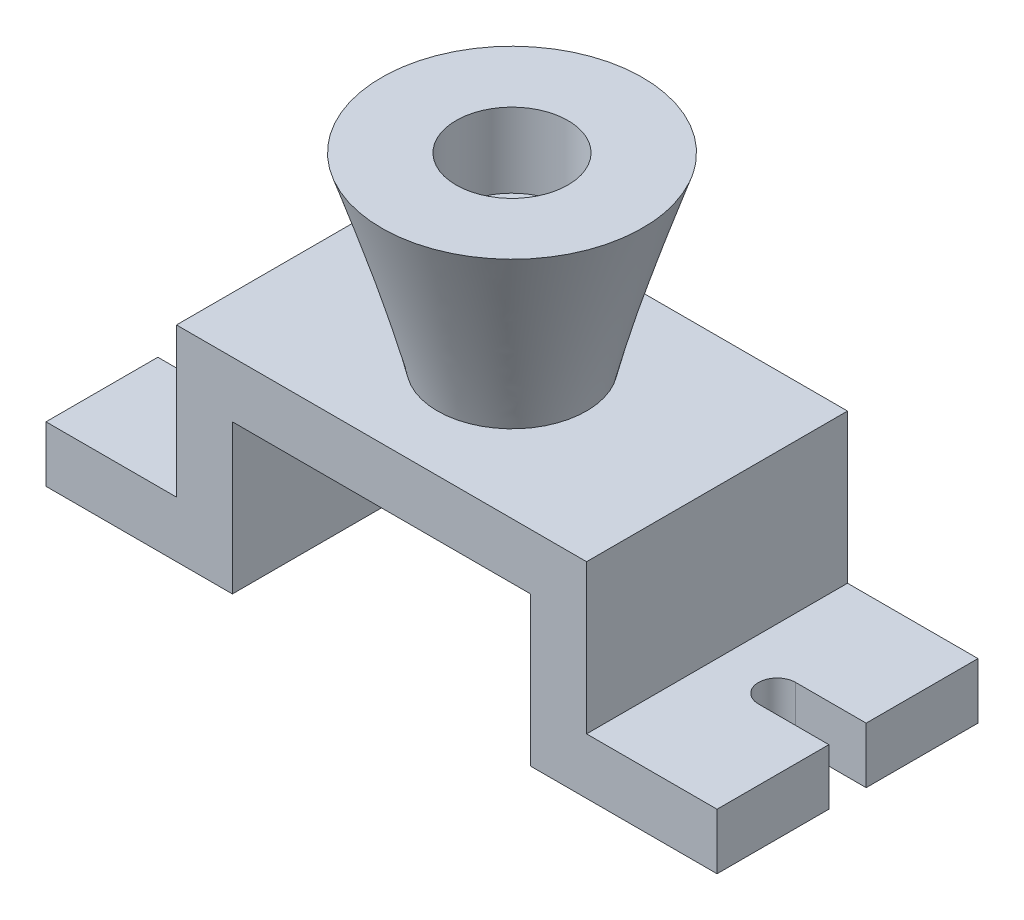
ISO-10303-21;
HEADER;
FILE_DESCRIPTION(('STEP AP214'),'2;1');
FILE_NAME('part.step','',(''),(''),'','','');
FILE_SCHEMA(('AUTOMOTIVE_DESIGN { 1 0 10303 214 1 1 1 1 }'));
ENDSEC;
DATA;
#1=APPLICATION_CONTEXT('core data for automotive mechanical design processes');
#2=APPLICATION_PROTOCOL_DEFINITION('international standard','automotive_design',2000,#1);
#3=PRODUCT_CONTEXT('',#1,'mechanical');
#4=PRODUCT('Part','Part','',(#3));
#5=PRODUCT_RELATED_PRODUCT_CATEGORY('part','',(#4));
#6=PRODUCT_DEFINITION_FORMATION('','',#4);
#7=PRODUCT_DEFINITION_CONTEXT('part definition',#1,'design');
#8=PRODUCT_DEFINITION('design','',#6,#7);
#9=PRODUCT_DEFINITION_SHAPE('','',#8);
#10=(LENGTH_UNIT() NAMED_UNIT(*) SI_UNIT(.MILLI.,.METRE.));
#11=(NAMED_UNIT(*) PLANE_ANGLE_UNIT() SI_UNIT($,.RADIAN.));
#12=(NAMED_UNIT(*) SI_UNIT($,.STERADIAN.) SOLID_ANGLE_UNIT());
#13=UNCERTAINTY_MEASURE_WITH_UNIT(LENGTH_MEASURE(1.E-05),#10,'distance_accuracy_value','');
#14=(GEOMETRIC_REPRESENTATION_CONTEXT(3) GLOBAL_UNCERTAINTY_ASSIGNED_CONTEXT((#13)) GLOBAL_UNIT_ASSIGNED_CONTEXT((#10,
#11,#12)) REPRESENTATION_CONTEXT('',''));
#15=CARTESIAN_POINT('',(0.,0.,0.));
#16=DIRECTION('',(0.,0.,1.));
#17=DIRECTION('',(1.,0.,0.));
#18=AXIS2_PLACEMENT_3D('',#15,#16,#17);
#19=CARTESIAN_POINT('',(-96.0194174757281,0.,35.));
#20=DIRECTION('',(1.,0.,0.));
#21=DIRECTION('',(0.,0.,-1.));
#22=AXIS2_PLACEMENT_3D('',#19,#20,#21);
#23=PLANE('',#22);
#24=DIRECTION('',(0.,0.,-1.));
#25=VECTOR('',#24,1.);
#26=CARTESIAN_POINT('',(-96.0194174757281,15.,35.));
#27=LINE('',#26,#25);
#28=CARTESIAN_POINT('',(-96.0194174757281,15.,35.));
#29=VERTEX_POINT('',#28);
#30=CARTESIAN_POINT('',(-96.0194174757281,15.,5.));
#31=VERTEX_POINT('',#30);
#32=EDGE_CURVE('E286',#29,#31,#27,.T.);
#33=ORIENTED_EDGE('',*,*,#32,.T.);
#34=DIRECTION('',(0.,-1.,0.));
#35=VECTOR('',#34,1.);
#36=CARTESIAN_POINT('',(-96.0194174757281,0.,5.));
#37=LINE('',#36,#35);
#38=CARTESIAN_POINT('',(-96.0194174757281,0.,5.));
#39=VERTEX_POINT('',#38);
#40=EDGE_CURVE('E12',#31,#39,#37,.T.);
#41=ORIENTED_EDGE('',*,*,#40,.T.);
#42=DIRECTION('',(0.,0.,-1.));
#43=VECTOR('',#42,1.);
#44=CARTESIAN_POINT('',(-96.0194174757281,0.,35.));
#45=LINE('',#44,#43);
#46=CARTESIAN_POINT('',(-96.0194174757281,0.,35.));
#47=VERTEX_POINT('',#46);
#48=EDGE_CURVE('E283',#47,#39,#45,.T.);
#49=ORIENTED_EDGE('',*,*,#48,.F.);
#50=DIRECTION('',(0.,-1.,0.));
#51=VECTOR('',#50,1.);
#52=CARTESIAN_POINT('',(-96.0194174757281,0.,35.));
#53=LINE('',#52,#51);
#54=EDGE_CURVE('E254',#29,#47,#53,.T.);
#55=ORIENTED_EDGE('',*,*,#54,.F.);
#56=EDGE_LOOP('',(#33,#41,#49,#55));
#57=FACE_BOUND('',#56,.T.);
#58=ADVANCED_FACE('F35',(#57),#23,.F.);
#59=CARTESIAN_POINT('',(83.9805825242719,15.,35.));
#60=DIRECTION('',(-1.,0.,0.));
#61=DIRECTION('',(0.,0.,1.));
#62=AXIS2_PLACEMENT_3D('',#59,#60,#61);
#63=PLANE('',#62);
#64=DIRECTION('',(0.,0.,-1.));
#65=VECTOR('',#64,1.);
#66=CARTESIAN_POINT('',(83.9805825242719,15.,35.));
#67=LINE('',#66,#65);
#68=CARTESIAN_POINT('',(83.9805825242719,15.,-5.));
#69=VERTEX_POINT('',#68);
#70=CARTESIAN_POINT('',(83.9805825242719,15.,-35.));
#71=VERTEX_POINT('',#70);
#72=EDGE_CURVE('E301',#69,#71,#67,.T.);
#73=ORIENTED_EDGE('',*,*,#72,.F.);
#74=DIRECTION('',(0.,1.,0.));
#75=VECTOR('',#74,1.);
#76=CARTESIAN_POINT('',(83.9805825242719,-55.,-5.));
#77=LINE('',#76,#75);
#78=CARTESIAN_POINT('',(83.9805825242719,0.,-5.));
#79=VERTEX_POINT('',#78);
#80=EDGE_CURVE('E215',#79,#69,#77,.T.);
#81=ORIENTED_EDGE('',*,*,#80,.F.);
#82=DIRECTION('',(0.,0.,-1.));
#83=VECTOR('',#82,1.);
#84=CARTESIAN_POINT('',(83.9805825242719,0.,35.));
#85=LINE('',#84,#83);
#86=CARTESIAN_POINT('',(83.9805825242719,0.,-35.));
#87=VERTEX_POINT('',#86);
#88=EDGE_CURVE('E305',#79,#87,#85,.T.);
#89=ORIENTED_EDGE('',*,*,#88,.T.);
#90=DIRECTION('',(0.,1.,0.));
#91=VECTOR('',#90,1.);
#92=CARTESIAN_POINT('',(83.9805825242719,15.,-35.));
#93=LINE('',#92,#91);
#94=EDGE_CURVE('E268',#87,#71,#93,.T.);
#95=ORIENTED_EDGE('',*,*,#94,.T.);
#96=EDGE_LOOP('',(#73,#81,#89,#95));
#97=FACE_BOUND('',#96,.T.);
#98=ADVANCED_FACE('F394',(#97),#63,.F.);
#99=CARTESIAN_POINT('',(-46.0194174757281,0.,35.));
#100=DIRECTION('',(0.,1.,0.));
#101=DIRECTION('',(-1.,0.,0.));
#102=AXIS2_PLACEMENT_3D('',#99,#100,#101);
#103=PLANE('',#102);
#104=ORIENTED_EDGE('',*,*,#48,.T.);
#105=DIRECTION('',(1.,0.,0.));
#106=VECTOR('',#105,1.);
#107=CARTESIAN_POINT('',(-46.0194174757281,0.,5.));
#108=LINE('',#107,#106);
#109=CARTESIAN_POINT('',(-77.1263526078353,0.,5.));
#110=VERTEX_POINT('',#109);
#111=EDGE_CURVE('E200',#39,#110,#108,.T.);
#112=ORIENTED_EDGE('',*,*,#111,.T.);
#113=CARTESIAN_POINT('',(-77.1263526078353,0.,0.));
#114=DIRECTION('',(0.,1.,0.));
#115=DIRECTION('',(-1.,0.,0.));
#116=AXIS2_PLACEMENT_3D('',#113,#114,#115);
#117=CIRCLE('',#116,5.);
#118=CARTESIAN_POINT('',(-77.1263526078353,0.,-5.));
#119=VERTEX_POINT('',#118);
#120=EDGE_CURVE('E203',#110,#119,#117,.T.);
#121=ORIENTED_EDGE('',*,*,#120,.T.);
#122=DIRECTION('',(-1.,0.,0.));
#123=VECTOR('',#122,1.);
#124=CARTESIAN_POINT('',(-46.0194174757281,0.,-5.));
#125=LINE('',#124,#123);
#126=CARTESIAN_POINT('',(-96.0194174757281,0.,-5.));
#127=VERTEX_POINT('',#126);
#128=EDGE_CURVE('E175',#119,#127,#125,.T.);
#129=ORIENTED_EDGE('',*,*,#128,.T.);
#130=CARTESIAN_POINT('',(-96.0194174757281,0.,-35.));
#131=VERTEX_POINT('',#130);
#132=EDGE_CURVE('E256',#127,#131,#45,.T.);
#133=ORIENTED_EDGE('',*,*,#132,.T.);
#134=DIRECTION('',(1.,0.,0.));
#135=VECTOR('',#134,1.);
#136=CARTESIAN_POINT('',(-46.0194174757281,0.,-35.));
#137=LINE('',#136,#135);
#138=CARTESIAN_POINT('',(-46.0194174757281,0.,-35.));
#139=VERTEX_POINT('',#138);
#140=EDGE_CURVE('E229',#131,#139,#137,.T.);
#141=ORIENTED_EDGE('',*,*,#140,.T.);
#142=DIRECTION('',(0.,0.,-1.));
#143=VECTOR('',#142,1.);
#144=CARTESIAN_POINT('',(-46.0194174757281,0.,35.));
#145=LINE('',#144,#143);
#146=CARTESIAN_POINT('',(-46.0194174757281,0.,35.));
#147=VERTEX_POINT('',#146);
#148=EDGE_CURVE('E318',#147,#139,#145,.T.);
#149=ORIENTED_EDGE('',*,*,#148,.F.);
#150=DIRECTION('',(1.,0.,0.));
#151=VECTOR('',#150,1.);
#152=CARTESIAN_POINT('',(-46.0194174757281,0.,35.));
#153=LINE('',#152,#151);
#154=EDGE_CURVE('E230',#47,#147,#153,.T.);
#155=ORIENTED_EDGE('',*,*,#154,.F.);
#156=EDGE_LOOP('',(#104,#112,#121,#129,#133,#141,#149,#155));
#157=FACE_BOUND('',#156,.T.);
#158=ADVANCED_FACE('F37',(#157),#103,.F.);
#159=CARTESIAN_POINT('',(-46.0194174757281,0.,35.));
#160=DIRECTION('',(-1.,0.,0.));
#161=DIRECTION('',(0.,0.,1.));
#162=AXIS2_PLACEMENT_3D('',#159,#160,#161);
#163=PLANE('',#162);
#164=DIRECTION('',(0.,1.,0.));
#165=VECTOR('',#164,1.);
#166=CARTESIAN_POINT('',(-46.0194174757281,0.,-35.));
#167=LINE('',#166,#165);
#168=CARTESIAN_POINT('',(-46.0194174757281,40.,-35.));
#169=VERTEX_POINT('',#168);
#170=EDGE_CURVE('E259',#139,#169,#167,.T.);
#171=ORIENTED_EDGE('',*,*,#170,.T.);
#172=DIRECTION('',(0.,0.,-1.));
#173=VECTOR('',#172,1.);
#174=CARTESIAN_POINT('',(-46.0194174757281,40.,35.));
#175=LINE('',#174,#173);
#176=CARTESIAN_POINT('',(-46.0194174757281,40.,35.));
#177=VERTEX_POINT('',#176);
#178=EDGE_CURVE('E315',#177,#169,#175,.T.);
#179=ORIENTED_EDGE('',*,*,#178,.F.);
#180=DIRECTION('',(0.,1.,0.));
#181=VECTOR('',#180,1.);
#182=CARTESIAN_POINT('',(-46.0194174757281,0.,35.));
#183=LINE('',#182,#181);
#184=EDGE_CURVE('E233',#147,#177,#183,.T.);
#185=ORIENTED_EDGE('',*,*,#184,.F.);
#186=ORIENTED_EDGE('',*,*,#148,.T.);
#187=EDGE_LOOP('',(#171,#179,#185,#186));
#188=FACE_BOUND('',#187,.T.);
#189=ADVANCED_FACE('F347',(#188),#163,.F.);
#190=CARTESIAN_POINT('',(-46.0194174757281,40.,35.));
#191=DIRECTION('',(0.,1.,0.));
#192=DIRECTION('',(0.,0.,1.));
#193=AXIS2_PLACEMENT_3D('',#190,#191,#192);
#194=PLANE('',#193);
#195=CARTESIAN_POINT('',(-6.01941747572811,40.,0.));
#196=DIRECTION('',(0.,-1.,0.));
#197=DIRECTION('',(0.,0.,-1.));
#198=AXIS2_PLACEMENT_3D('',#195,#196,#197);
#199=CIRCLE('',#198,8.);
#200=CARTESIAN_POINT('',(-6.01941747572811,40.,-8.));
#201=VERTEX_POINT('',#200);
#202=EDGE_CURVE('E480',#201,#201,#199,.T.);
#203=ORIENTED_EDGE('',*,*,#202,.F.);
#204=EDGE_LOOP('',(#203));
#205=FACE_BOUND('',#204,.T.);
#206=DIRECTION('',(1.,0.,0.));
#207=VECTOR('',#206,1.);
#208=CARTESIAN_POINT('',(-46.0194174757281,40.,-35.));
#209=LINE('',#208,#207);
#210=CARTESIAN_POINT('',(33.9805825242719,40.,-35.));
#211=VERTEX_POINT('',#210);
#212=EDGE_CURVE('E261',#169,#211,#209,.T.);
#213=ORIENTED_EDGE('',*,*,#212,.T.);
#214=DIRECTION('',(0.,0.,-1.));
#215=VECTOR('',#214,1.);
#216=CARTESIAN_POINT('',(33.9805825242719,40.,35.));
#217=LINE('',#216,#215);
#218=CARTESIAN_POINT('',(33.9805825242719,40.,35.));
#219=VERTEX_POINT('',#218);
#220=EDGE_CURVE('E312',#219,#211,#217,.T.);
#221=ORIENTED_EDGE('',*,*,#220,.F.);
#222=DIRECTION('',(1.,0.,0.));
#223=VECTOR('',#222,1.);
#224=CARTESIAN_POINT('',(-46.0194174757281,40.,35.));
#225=LINE('',#224,#223);
#226=EDGE_CURVE('E236',#177,#219,#225,.T.);
#227=ORIENTED_EDGE('',*,*,#226,.F.);
#228=ORIENTED_EDGE('',*,*,#178,.T.);
#229=EDGE_LOOP('',(#213,#221,#227,#228));
#230=FACE_BOUND('',#229,.T.);
#231=ADVANCED_FACE('F354',(#205,#230),#194,.F.);
#232=CARTESIAN_POINT('',(33.9805825242719,40.,35.));
#233=DIRECTION('',(1.,0.,0.));
#234=DIRECTION('',(0.,1.,0.));
#235=AXIS2_PLACEMENT_3D('',#232,#233,#234);
#236=PLANE('',#235);
#237=DIRECTION('',(0.,-1.,0.));
#238=VECTOR('',#237,1.);
#239=CARTESIAN_POINT('',(33.9805825242719,40.,-35.));
#240=LINE('',#239,#238);
#241=CARTESIAN_POINT('',(33.9805825242719,0.,-35.));
#242=VERTEX_POINT('',#241);
#243=EDGE_CURVE('E263',#211,#242,#240,.T.);
#244=ORIENTED_EDGE('',*,*,#243,.T.);
#245=DIRECTION('',(0.,0.,-1.));
#246=VECTOR('',#245,1.);
#247=CARTESIAN_POINT('',(33.9805825242719,0.,35.));
#248=LINE('',#247,#246);
#249=CARTESIAN_POINT('',(33.9805825242719,0.,35.));
#250=VERTEX_POINT('',#249);
#251=EDGE_CURVE('E309',#250,#242,#248,.T.);
#252=ORIENTED_EDGE('',*,*,#251,.F.);
#253=DIRECTION('',(0.,-1.,0.));
#254=VECTOR('',#253,1.);
#255=CARTESIAN_POINT('',(33.9805825242719,40.,35.));
#256=LINE('',#255,#254);
#257=EDGE_CURVE('E238',#219,#250,#256,.T.);
#258=ORIENTED_EDGE('',*,*,#257,.F.);
#259=ORIENTED_EDGE('',*,*,#220,.T.);
#260=EDGE_LOOP('',(#244,#252,#258,#259));
#261=FACE_BOUND('',#260,.T.);
#262=ADVANCED_FACE('F357',(#261),#236,.F.);
#263=CARTESIAN_POINT('',(83.9805825242719,0.,35.));
#264=DIRECTION('',(0.,1.,0.));
#265=DIRECTION('',(-1.,0.,0.));
#266=AXIS2_PLACEMENT_3D('',#263,#264,#265);
#267=PLANE('',#266);
#268=ORIENTED_EDGE('',*,*,#88,.F.);
#269=DIRECTION('',(-1.,0.,0.));
#270=VECTOR('',#269,1.);
#271=CARTESIAN_POINT('',(83.9805825242719,0.,-5.));
#272=LINE('',#271,#270);
#273=CARTESIAN_POINT('',(65.0875176563791,0.,-5.));
#274=VERTEX_POINT('',#273);
#275=EDGE_CURVE('E223',#79,#274,#272,.T.);
#276=ORIENTED_EDGE('',*,*,#275,.T.);
#277=CARTESIAN_POINT('',(65.0875176563791,0.,0.));
#278=DIRECTION('',(0.,1.,0.));
#279=DIRECTION('',(-1.,0.,0.));
#280=AXIS2_PLACEMENT_3D('',#277,#278,#279);
#281=CIRCLE('',#280,5.);
#282=CARTESIAN_POINT('',(65.0875176563791,0.,5.));
#283=VERTEX_POINT('',#282);
#284=EDGE_CURVE('E226',#274,#283,#281,.T.);
#285=ORIENTED_EDGE('',*,*,#284,.T.);
#286=DIRECTION('',(1.,0.,0.));
#287=VECTOR('',#286,1.);
#288=CARTESIAN_POINT('',(83.9805825242719,0.,5.));
#289=LINE('',#288,#287);
#290=CARTESIAN_POINT('',(83.9805825242719,0.,5.));
#291=VERTEX_POINT('',#290);
#292=EDGE_CURVE('E214',#283,#291,#289,.T.);
#293=ORIENTED_EDGE('',*,*,#292,.T.);
#294=CARTESIAN_POINT('',(83.9805825242719,0.,35.));
#295=VERTEX_POINT('',#294);
#296=EDGE_CURVE('E306',#295,#291,#85,.T.);
#297=ORIENTED_EDGE('',*,*,#296,.F.);
#298=DIRECTION('',(1.,0.,0.));
#299=VECTOR('',#298,1.);
#300=CARTESIAN_POINT('',(83.9805825242719,0.,35.));
#301=LINE('',#300,#299);
#302=EDGE_CURVE('E240',#250,#295,#301,.T.);
#303=ORIENTED_EDGE('',*,*,#302,.F.);
#304=ORIENTED_EDGE('',*,*,#251,.T.);
#305=DIRECTION('',(1.,0.,0.));
#306=VECTOR('',#305,1.);
#307=CARTESIAN_POINT('',(83.9805825242719,0.,-35.));
#308=LINE('',#307,#306);
#309=EDGE_CURVE('E265',#242,#87,#308,.T.);
#310=ORIENTED_EDGE('',*,*,#309,.T.);
#311=EDGE_LOOP('',(#268,#276,#285,#293,#297,#303,#304,#310));
#312=FACE_BOUND('',#311,.T.);
#313=ADVANCED_FACE('F363',(#312),#267,.F.);
#314=ORIENTED_EDGE('',*,*,#296,.T.);
#315=DIRECTION('',(0.,1.,0.));
#316=VECTOR('',#315,1.);
#317=CARTESIAN_POINT('',(83.9805825242719,-55.,5.));
#318=LINE('',#317,#316);
#319=CARTESIAN_POINT('',(83.9805825242719,15.,5.));
#320=VERTEX_POINT('',#319);
#321=EDGE_CURVE('E217',#291,#320,#318,.T.);
#322=ORIENTED_EDGE('',*,*,#321,.T.);
#323=CARTESIAN_POINT('',(83.9805825242719,15.,35.));
#324=VERTEX_POINT('',#323);
#325=EDGE_CURVE('E302',#324,#320,#67,.T.);
#326=ORIENTED_EDGE('',*,*,#325,.F.);
#327=DIRECTION('',(0.,1.,0.));
#328=VECTOR('',#327,1.);
#329=CARTESIAN_POINT('',(83.9805825242719,15.,35.));
#330=LINE('',#329,#328);
#331=EDGE_CURVE('E242',#295,#324,#330,.T.);
#332=ORIENTED_EDGE('',*,*,#331,.F.);
#333=EDGE_LOOP('',(#314,#322,#326,#332));
#334=FACE_BOUND('',#333,.T.);
#335=ADVANCED_FACE('F369',(#334),#63,.F.);
#336=CARTESIAN_POINT('',(48.9805825242719,15.,35.));
#337=DIRECTION('',(0.,-1.,0.));
#338=DIRECTION('',(0.,0.,-1.));
#339=AXIS2_PLACEMENT_3D('',#336,#337,#338);
#340=PLANE('',#339);
#341=CARTESIAN_POINT('',(65.0875176563791,15.,0.));
#342=DIRECTION('',(0.,1.,0.));
#343=DIRECTION('',(0.,0.,1.));
#344=AXIS2_PLACEMENT_3D('',#341,#342,#343);
#345=CIRCLE('',#344,5.);
#346=CARTESIAN_POINT('',(65.0875176563791,15.,-5.));
#347=VERTEX_POINT('',#346);
#348=CARTESIAN_POINT('',(65.0875176563791,15.,5.));
#349=VERTEX_POINT('',#348);
#350=EDGE_CURVE('E58',#347,#349,#345,.T.);
#351=ORIENTED_EDGE('',*,*,#350,.F.);
#352=DIRECTION('',(-1.,0.,0.));
#353=VECTOR('',#352,1.);
#354=CARTESIAN_POINT('',(65.0875176563791,15.,-5.));
#355=LINE('',#354,#353);
#356=EDGE_CURVE('E208',#69,#347,#355,.T.);
#357=ORIENTED_EDGE('',*,*,#356,.F.);
#358=ORIENTED_EDGE('',*,*,#72,.T.);
#359=DIRECTION('',(-1.,0.,0.));
#360=VECTOR('',#359,1.);
#361=CARTESIAN_POINT('',(48.9805825242719,15.,-35.));
#362=LINE('',#361,#360);
#363=CARTESIAN_POINT('',(48.9805825242719,15.,-35.));
#364=VERTEX_POINT('',#363);
#365=EDGE_CURVE('E271',#71,#364,#362,.T.);
#366=ORIENTED_EDGE('',*,*,#365,.T.);
#367=DIRECTION('',(0.,0.,-1.));
#368=VECTOR('',#367,1.);
#369=CARTESIAN_POINT('',(48.9805825242719,15.,35.));
#370=LINE('',#369,#368);
#371=CARTESIAN_POINT('',(48.9805825242719,15.,35.));
#372=VERTEX_POINT('',#371);
#373=EDGE_CURVE('E298',#372,#364,#370,.T.);
#374=ORIENTED_EDGE('',*,*,#373,.F.);
#375=DIRECTION('',(-1.,0.,0.));
#376=VECTOR('',#375,1.);
#377=CARTESIAN_POINT('',(48.9805825242719,15.,35.));
#378=LINE('',#377,#376);
#379=EDGE_CURVE('E244',#324,#372,#378,.T.);
#380=ORIENTED_EDGE('',*,*,#379,.F.);
#381=ORIENTED_EDGE('',*,*,#325,.T.);
#382=DIRECTION('',(1.,0.,0.));
#383=VECTOR('',#382,1.);
#384=CARTESIAN_POINT('',(65.0875176563791,15.,5.));
#385=LINE('',#384,#383);
#386=EDGE_CURVE('E206',#349,#320,#385,.T.);
#387=ORIENTED_EDGE('',*,*,#386,.F.);
#388=EDGE_LOOP('',(#351,#357,#358,#366,#374,#380,#381,#387));
#389=FACE_BOUND('',#388,.T.);
#390=ADVANCED_FACE('F372',(#389),#340,.F.);
#391=CARTESIAN_POINT('',(48.9805825242719,55.,35.));
#392=DIRECTION('',(-1.,0.,0.));
#393=DIRECTION('',(0.,-1.,0.));
#394=AXIS2_PLACEMENT_3D('',#391,#392,#393);
#395=PLANE('',#394);
#396=DIRECTION('',(0.,1.,0.));
#397=VECTOR('',#396,1.);
#398=CARTESIAN_POINT('',(48.9805825242719,55.,-35.));
#399=LINE('',#398,#397);
#400=CARTESIAN_POINT('',(48.9805825242719,55.,-35.));
#401=VERTEX_POINT('',#400);
#402=EDGE_CURVE('E273',#364,#401,#399,.T.);
#403=ORIENTED_EDGE('',*,*,#402,.T.);
#404=DIRECTION('',(0.,0.,-1.));
#405=VECTOR('',#404,1.);
#406=CARTESIAN_POINT('',(48.9805825242719,55.,35.));
#407=LINE('',#406,#405);
#408=CARTESIAN_POINT('',(48.9805825242719,55.,35.));
#409=VERTEX_POINT('',#408);
#410=EDGE_CURVE('E295',#409,#401,#407,.T.);
#411=ORIENTED_EDGE('',*,*,#410,.F.);
#412=DIRECTION('',(0.,1.,0.));
#413=VECTOR('',#412,1.);
#414=CARTESIAN_POINT('',(48.9805825242719,55.,35.));
#415=LINE('',#414,#413);
#416=EDGE_CURVE('E246',#372,#409,#415,.T.);
#417=ORIENTED_EDGE('',*,*,#416,.F.);
#418=ORIENTED_EDGE('',*,*,#373,.T.);
#419=EDGE_LOOP('',(#403,#411,#417,#418));
#420=FACE_BOUND('',#419,.T.);
#421=ADVANCED_FACE('F378',(#420),#395,.F.);
#422=CARTESIAN_POINT('',(-61.0194174757281,55.,35.));
#423=DIRECTION('',(0.,-1.,0.));
#424=DIRECTION('',(0.,0.,-1.));
#425=AXIS2_PLACEMENT_3D('',#422,#423,#424);
#426=PLANE('',#425);
#427=CARTESIAN_POINT('',(-6.0194174757281,55.,0.));
#428=DIRECTION('',(0.,1.,0.));
#429=DIRECTION('',(0.,0.,1.));
#430=AXIS2_PLACEMENT_3D('',#427,#428,#429);
#431=CIRCLE('',#430,20.);
#432=CARTESIAN_POINT('',(-26.008227644309,55.,-0.668930522877718));
#433=VERTEX_POINT('',#432);
#434=EDGE_CURVE('E188',#433,#433,#431,.T.);
#435=ORIENTED_EDGE('',*,*,#434,.F.);
#436=EDGE_LOOP('',(#435));
#437=FACE_BOUND('',#436,.T.);
#438=DIRECTION('',(-1.,0.,0.));
#439=VECTOR('',#438,1.);
#440=CARTESIAN_POINT('',(-61.0194174757281,55.,-35.));
#441=LINE('',#440,#439);
#442=CARTESIAN_POINT('',(-61.0194174757281,55.,-35.));
#443=VERTEX_POINT('',#442);
#444=EDGE_CURVE('E275',#401,#443,#441,.T.);
#445=ORIENTED_EDGE('',*,*,#444,.T.);
#446=DIRECTION('',(0.,0.,-1.));
#447=VECTOR('',#446,1.);
#448=CARTESIAN_POINT('',(-61.0194174757281,55.,35.));
#449=LINE('',#448,#447);
#450=CARTESIAN_POINT('',(-61.0194174757281,55.,35.));
#451=VERTEX_POINT('',#450);
#452=EDGE_CURVE('E292',#451,#443,#449,.T.);
#453=ORIENTED_EDGE('',*,*,#452,.F.);
#454=DIRECTION('',(-1.,0.,0.));
#455=VECTOR('',#454,1.);
#456=CARTESIAN_POINT('',(-61.0194174757281,55.,35.));
#457=LINE('',#456,#455);
#458=EDGE_CURVE('E248',#409,#451,#457,.T.);
#459=ORIENTED_EDGE('',*,*,#458,.F.);
#460=ORIENTED_EDGE('',*,*,#410,.T.);
#461=EDGE_LOOP('',(#445,#453,#459,#460));
#462=FACE_BOUND('',#461,.T.);
#463=ADVANCED_FACE('F382',(#437,#462),#426,.F.);
#464=CARTESIAN_POINT('',(-61.0194174757281,15.,35.));
#465=DIRECTION('',(1.,0.,0.));
#466=DIRECTION('',(0.,0.,-1.));
#467=AXIS2_PLACEMENT_3D('',#464,#465,#466);
#468=PLANE('',#467);
#469=DIRECTION('',(0.,-1.,0.));
#470=VECTOR('',#469,1.);
#471=CARTESIAN_POINT('',(-61.0194174757281,15.,-35.));
#472=LINE('',#471,#470);
#473=CARTESIAN_POINT('',(-61.0194174757281,15.,-35.));
#474=VERTEX_POINT('',#473);
#475=EDGE_CURVE('E277',#443,#474,#472,.T.);
#476=ORIENTED_EDGE('',*,*,#475,.T.);
#477=DIRECTION('',(0.,0.,-1.));
#478=VECTOR('',#477,1.);
#479=CARTESIAN_POINT('',(-61.0194174757281,15.,35.));
#480=LINE('',#479,#478);
#481=CARTESIAN_POINT('',(-61.0194174757281,15.,35.));
#482=VERTEX_POINT('',#481);
#483=EDGE_CURVE('E289',#482,#474,#480,.T.);
#484=ORIENTED_EDGE('',*,*,#483,.F.);
#485=DIRECTION('',(0.,-1.,0.));
#486=VECTOR('',#485,1.);
#487=CARTESIAN_POINT('',(-61.0194174757281,15.,35.));
#488=LINE('',#487,#486);
#489=EDGE_CURVE('E250',#451,#482,#488,.T.);
#490=ORIENTED_EDGE('',*,*,#489,.F.);
#491=ORIENTED_EDGE('',*,*,#452,.T.);
#492=EDGE_LOOP('',(#476,#484,#490,#491));
#493=FACE_BOUND('',#492,.T.);
#494=ADVANCED_FACE('F383',(#493),#468,.F.);
#495=CARTESIAN_POINT('',(-96.0194174757281,15.,35.));
#496=DIRECTION('',(0.,-1.,0.));
#497=DIRECTION('',(0.,0.,-1.));
#498=AXIS2_PLACEMENT_3D('',#495,#496,#497);
#499=PLANE('',#498);
#500=CARTESIAN_POINT('',(-77.1263526078353,15.,0.));
#501=DIRECTION('',(0.,1.,0.));
#502=DIRECTION('',(0.,0.,-1.));
#503=AXIS2_PLACEMENT_3D('',#500,#501,#502);
#504=CIRCLE('',#503,5.);
#505=CARTESIAN_POINT('',(-77.1263526078353,15.,5.));
#506=VERTEX_POINT('',#505);
#507=CARTESIAN_POINT('',(-77.1263526078353,15.,-5.));
#508=VERTEX_POINT('',#507);
#509=EDGE_CURVE('E182',#506,#508,#504,.T.);
#510=ORIENTED_EDGE('',*,*,#509,.F.);
#511=DIRECTION('',(1.,0.,0.));
#512=VECTOR('',#511,1.);
#513=CARTESIAN_POINT('',(-77.1263526078353,15.,5.));
#514=LINE('',#513,#512);
#515=EDGE_CURVE('E179',#31,#506,#514,.T.);
#516=ORIENTED_EDGE('',*,*,#515,.F.);
#517=ORIENTED_EDGE('',*,*,#32,.F.);
#518=DIRECTION('',(-1.,0.,0.));
#519=VECTOR('',#518,1.);
#520=CARTESIAN_POINT('',(-96.0194174757281,15.,35.));
#521=LINE('',#520,#519);
#522=EDGE_CURVE('E252',#482,#29,#521,.T.);
#523=ORIENTED_EDGE('',*,*,#522,.F.);
#524=ORIENTED_EDGE('',*,*,#483,.T.);
#525=DIRECTION('',(-1.,0.,0.));
#526=VECTOR('',#525,1.);
#527=CARTESIAN_POINT('',(-96.0194174757281,15.,-35.));
#528=LINE('',#527,#526);
#529=CARTESIAN_POINT('',(-96.0194174757281,15.,-35.));
#530=VERTEX_POINT('',#529);
#531=EDGE_CURVE('E279',#474,#530,#528,.T.);
#532=ORIENTED_EDGE('',*,*,#531,.T.);
#533=CARTESIAN_POINT('',(-96.0194174757281,15.,-5.));
#534=VERTEX_POINT('',#533);
#535=EDGE_CURVE('E193',#534,#530,#27,.T.);
#536=ORIENTED_EDGE('',*,*,#535,.F.);
#537=DIRECTION('',(-1.,0.,0.));
#538=VECTOR('',#537,1.);
#539=CARTESIAN_POINT('',(-77.1263526078353,15.,-5.));
#540=LINE('',#539,#538);
#541=EDGE_CURVE('E50',#508,#534,#540,.T.);
#542=ORIENTED_EDGE('',*,*,#541,.F.);
#543=EDGE_LOOP('',(#510,#516,#517,#523,#524,#532,#536,#542));
#544=FACE_BOUND('',#543,.T.);
#545=ADVANCED_FACE('F191',(#544),#499,.F.);
#546=ORIENTED_EDGE('',*,*,#132,.F.);
#547=DIRECTION('',(0.,1.,0.));
#548=VECTOR('',#547,1.);
#549=CARTESIAN_POINT('',(-96.0194174757281,0.,-5.));
#550=LINE('',#549,#548);
#551=EDGE_CURVE('E43',#127,#534,#550,.T.);
#552=ORIENTED_EDGE('',*,*,#551,.T.);
#553=ORIENTED_EDGE('',*,*,#535,.T.);
#554=DIRECTION('',(0.,-1.,0.));
#555=VECTOR('',#554,1.);
#556=CARTESIAN_POINT('',(-96.0194174757281,0.,-35.));
#557=LINE('',#556,#555);
#558=EDGE_CURVE('E234',#530,#131,#557,.T.);
#559=ORIENTED_EDGE('',*,*,#558,.T.);
#560=EDGE_LOOP('',(#546,#552,#553,#559));
#561=FACE_BOUND('',#560,.T.);
#562=ADVANCED_FACE('F322',(#561),#23,.F.);
#563=CARTESIAN_POINT('',(0.,0.,35.));
#564=DIRECTION('',(0.,0.,-1.));
#565=DIRECTION('',(-1.,0.,0.));
#566=AXIS2_PLACEMENT_3D('',#563,#564,#565);
#567=PLANE('',#566);
#568=ORIENTED_EDGE('',*,*,#154,.T.);
#569=ORIENTED_EDGE('',*,*,#184,.T.);
#570=ORIENTED_EDGE('',*,*,#226,.T.);
#571=ORIENTED_EDGE('',*,*,#257,.T.);
#572=ORIENTED_EDGE('',*,*,#302,.T.);
#573=ORIENTED_EDGE('',*,*,#331,.T.);
#574=ORIENTED_EDGE('',*,*,#379,.T.);
#575=ORIENTED_EDGE('',*,*,#416,.T.);
#576=ORIENTED_EDGE('',*,*,#458,.T.);
#577=ORIENTED_EDGE('',*,*,#489,.T.);
#578=ORIENTED_EDGE('',*,*,#522,.T.);
#579=ORIENTED_EDGE('',*,*,#54,.T.);
#580=EDGE_LOOP('',(#568,#569,#570,#571,#572,#573,#574,#575,#576,#577,#578,#579));
#581=FACE_BOUND('',#580,.T.);
#582=ADVANCED_FACE('F333',(#581),#567,.F.);
#583=CARTESIAN_POINT('',(0.,0.,-35.));
#584=DIRECTION('',(0.,0.,-1.));
#585=DIRECTION('',(-1.,0.,0.));
#586=AXIS2_PLACEMENT_3D('',#583,#584,#585);
#587=PLANE('',#586);
#588=ORIENTED_EDGE('',*,*,#140,.F.);
#589=ORIENTED_EDGE('',*,*,#558,.F.);
#590=ORIENTED_EDGE('',*,*,#531,.F.);
#591=ORIENTED_EDGE('',*,*,#475,.F.);
#592=ORIENTED_EDGE('',*,*,#444,.F.);
#593=ORIENTED_EDGE('',*,*,#402,.F.);
#594=ORIENTED_EDGE('',*,*,#365,.F.);
#595=ORIENTED_EDGE('',*,*,#94,.F.);
#596=ORIENTED_EDGE('',*,*,#309,.F.);
#597=ORIENTED_EDGE('',*,*,#243,.F.);
#598=ORIENTED_EDGE('',*,*,#212,.F.);
#599=ORIENTED_EDGE('',*,*,#170,.F.);
#600=EDGE_LOOP('',(#588,#589,#590,#591,#592,#593,#594,#595,#596,#597,#598,#599));
#601=FACE_BOUND('',#600,.T.);
#602=ADVANCED_FACE('F343',(#601),#587,.T.);
#603=CARTESIAN_POINT('',(65.0875176563791,-55.,0.));
#604=DIRECTION('',(0.,1.,0.));
#605=DIRECTION('',(0.,0.,1.));
#606=AXIS2_PLACEMENT_3D('',#603,#604,#605);
#607=CYLINDRICAL_SURFACE('',#606,5.);
#608=DIRECTION('',(0.,1.,0.));
#609=VECTOR('',#608,1.);
#610=CARTESIAN_POINT('',(65.0875176563791,-55.,-5.));
#611=LINE('',#610,#609);
#612=EDGE_CURVE('E212',#274,#347,#611,.T.);
#613=ORIENTED_EDGE('',*,*,#612,.T.);
#614=ORIENTED_EDGE('',*,*,#350,.T.);
#615=DIRECTION('',(0.,1.,0.));
#616=VECTOR('',#615,1.);
#617=CARTESIAN_POINT('',(65.0875176563791,-55.,5.));
#618=LINE('',#617,#616);
#619=EDGE_CURVE('E211',#283,#349,#618,.T.);
#620=ORIENTED_EDGE('',*,*,#619,.F.);
#621=ORIENTED_EDGE('',*,*,#284,.F.);
#622=EDGE_LOOP('',(#613,#614,#620,#621));
#623=FACE_BOUND('',#622,.T.);
#624=ADVANCED_FACE('F410',(#623),#607,.F.);
#625=CARTESIAN_POINT('',(65.0875176563791,-55.,-5.));
#626=DIRECTION('',(0.,0.,-1.));
#627=DIRECTION('',(-1.,0.,0.));
#628=AXIS2_PLACEMENT_3D('',#625,#626,#627);
#629=PLANE('',#628);
#630=ORIENTED_EDGE('',*,*,#80,.T.);
#631=ORIENTED_EDGE('',*,*,#356,.T.);
#632=ORIENTED_EDGE('',*,*,#612,.F.);
#633=ORIENTED_EDGE('',*,*,#275,.F.);
#634=EDGE_LOOP('',(#630,#631,#632,#633));
#635=FACE_BOUND('',#634,.T.);
#636=ADVANCED_FACE('F414',(#635),#629,.F.);
#637=CARTESIAN_POINT('',(65.0875176563791,-55.,5.));
#638=DIRECTION('',(0.,0.,1.));
#639=DIRECTION('',(1.,0.,0.));
#640=AXIS2_PLACEMENT_3D('',#637,#638,#639);
#641=PLANE('',#640);
#642=ORIENTED_EDGE('',*,*,#619,.T.);
#643=ORIENTED_EDGE('',*,*,#386,.T.);
#644=ORIENTED_EDGE('',*,*,#321,.F.);
#645=ORIENTED_EDGE('',*,*,#292,.F.);
#646=EDGE_LOOP('',(#642,#643,#644,#645));
#647=FACE_BOUND('',#646,.T.);
#648=ADVANCED_FACE('F415',(#647),#641,.F.);
#649=CARTESIAN_POINT('',(-77.1263526078353,-55.,0.));
#650=DIRECTION('',(0.,1.,0.));
#651=DIRECTION('',(0.,0.,1.));
#652=AXIS2_PLACEMENT_3D('',#649,#650,#651);
#653=CYLINDRICAL_SURFACE('',#652,5.);
#654=DIRECTION('',(0.,1.,0.));
#655=VECTOR('',#654,1.);
#656=CARTESIAN_POINT('',(-77.1263526078353,-55.,5.));
#657=LINE('',#656,#655);
#658=EDGE_CURVE('E178',#110,#506,#657,.T.);
#659=ORIENTED_EDGE('',*,*,#658,.T.);
#660=ORIENTED_EDGE('',*,*,#509,.T.);
#661=DIRECTION('',(0.,1.,0.));
#662=VECTOR('',#661,1.);
#663=CARTESIAN_POINT('',(-77.1263526078353,-55.,-5.));
#664=LINE('',#663,#662);
#665=EDGE_CURVE('E171',#119,#508,#664,.T.);
#666=ORIENTED_EDGE('',*,*,#665,.F.);
#667=ORIENTED_EDGE('',*,*,#120,.F.);
#668=EDGE_LOOP('',(#659,#660,#666,#667));
#669=FACE_BOUND('',#668,.T.);
#670=ADVANCED_FACE('F183',(#669),#653,.F.);
#671=CARTESIAN_POINT('',(-77.1263526078353,-55.,5.));
#672=DIRECTION('',(0.,0.,1.));
#673=DIRECTION('',(1.,0.,0.));
#674=AXIS2_PLACEMENT_3D('',#671,#672,#673);
#675=PLANE('',#674);
#676=ORIENTED_EDGE('',*,*,#40,.F.);
#677=ORIENTED_EDGE('',*,*,#515,.T.);
#678=ORIENTED_EDGE('',*,*,#658,.F.);
#679=ORIENTED_EDGE('',*,*,#111,.F.);
#680=EDGE_LOOP('',(#676,#677,#678,#679));
#681=FACE_BOUND('',#680,.T.);
#682=ADVANCED_FACE('F325',(#681),#675,.F.);
#683=CARTESIAN_POINT('',(-77.1263526078353,-55.,-5.));
#684=DIRECTION('',(0.,0.,-1.));
#685=DIRECTION('',(-1.,0.,0.));
#686=AXIS2_PLACEMENT_3D('',#683,#684,#685);
#687=PLANE('',#686);
#688=ORIENTED_EDGE('',*,*,#665,.T.);
#689=ORIENTED_EDGE('',*,*,#541,.T.);
#690=ORIENTED_EDGE('',*,*,#551,.F.);
#691=ORIENTED_EDGE('',*,*,#128,.F.);
#692=EDGE_LOOP('',(#688,#689,#690,#691));
#693=FACE_BOUND('',#692,.T.);
#694=ADVANCED_FACE('F173',(#693),#687,.F.);
#695=CARTESIAN_POINT('',(-6.0194174757281,105.,0.));
#696=DIRECTION('',(0.,1.,0.));
#697=DIRECTION('',(0.,0.,1.));
#698=AXIS2_PLACEMENT_3D('',#695,#696,#697);
#699=PLANE('',#698);
#700=CARTESIAN_POINT('',(-6.0194174757281,105.,0.));
#701=DIRECTION('',(0.,1.,0.));
#702=DIRECTION('',(0.,0.,1.));
#703=AXIS2_PLACEMENT_3D('',#700,#701,#702);
#704=CIRCLE('',#703,15.);
#705=CARTESIAN_POINT('',(-6.0194174757281,105.,15.));
#706=VERTEX_POINT('',#705);
#707=EDGE_CURVE('E475',#706,#706,#704,.T.);
#708=ORIENTED_EDGE('',*,*,#707,.F.);
#709=EDGE_LOOP('',(#708));
#710=FACE_BOUND('',#709,.T.);
#711=CARTESIAN_POINT('',(-6.0194174757281,105.,0.));
#712=DIRECTION('',(0.,1.,0.));
#713=DIRECTION('',(0.,0.,1.));
#714=AXIS2_PLACEMENT_3D('',#711,#712,#713);
#715=CIRCLE('',#714,35.);
#716=CARTESIAN_POINT('',(-38.2925021880286,105.,13.5442978095092));
#717=VERTEX_POINT('',#716);
#718=EDGE_CURVE('E459',#717,#717,#715,.T.);
#719=ORIENTED_EDGE('',*,*,#718,.T.);
#720=EDGE_LOOP('',(#719));
#721=FACE_BOUND('',#720,.T.);
#722=ADVANCED_FACE('F426',(#710,#721),#699,.T.);
#723=CARTESIAN_POINT('',(-38.2925021880286,105.,13.5442978095092));
#724=CARTESIAN_POINT('',(-26.008227644309,55.,-0.668930522877718));
#725=CARTESIAN_POINT('',(-65.381097807047,105.,-51.0018716150918));
#726=CARTESIAN_POINT('',(-24.6703665985535,55.,-40.6465508600395));
#727=CARTESIAN_POINT('',(-0.834928382445987,105.,-78.0904672341102));
#728=CARTESIAN_POINT('',(15.3072537386082,55.,-39.308689814284));
#729=CARTESIAN_POINT('',(26.2536672365724,105.,-13.5442978095092));
#730=CARTESIAN_POINT('',(13.9693926928528,55.,0.668930522877715));
#731=CARTESIAN_POINT('',(53.3422628555908,105.,51.0018716150918));
#732=CARTESIAN_POINT('',(12.6315316470974,55.,40.6465508600395));
#733=CARTESIAN_POINT('',(-11.2039065690102,105.,78.0904672341102));
#734=CARTESIAN_POINT('',(-27.3460886900644,55.,39.308689814284));
#735=CARTESIAN_POINT('',(-38.2925021880286,105.,13.5442978095092));
#736=CARTESIAN_POINT('',(-26.008227644309,55.,-0.668930522877718));
#737=(BOUNDED_SURFACE() B_SPLINE_SURFACE(3,1,((#723,#724),(#725,#726),(#727,#728),(#729,#730),
(#731,#732),(#733,#734),(#735,#736)),.UNSPECIFIED.,.T.,.F.,.F.) B_SPLINE_SURFACE_WITH_KNOTS((4,
3,4),(2,2),(0.,0.5,1.),(0.,1.),
.UNSPECIFIED.) GEOMETRIC_REPRESENTATION_ITEM() RATIONAL_B_SPLINE_SURFACE(((1.,1.),
(0.333333333333333,0.333333333333333),(0.333333333333333,0.333333333333333),(1.,1.),
(0.333333333333334,0.333333333333333),(0.333333333333334,0.333333333333333),(1.,1.))) REPRESENTATION_ITEM('') SURFACE());
#738=CARTESIAN_POINT('',(-38.2925021880286,105.,13.5442978095092));
#739=CARTESIAN_POINT('',(-38.1645409948649,104.479166666667,13.3962433477135));
#740=CARTESIAN_POINT('',(-38.0365798017011,103.958333333333,13.2481888859178));
#741=CARTESIAN_POINT('',(-37.7806574153736,102.916666666667,12.9520799623264));
#742=CARTESIAN_POINT('',(-37.6526962222099,102.395833333333,12.8040255005307));
#743=CARTESIAN_POINT('',(-37.3967738358824,101.354166666667,12.5079165769393));
#744=CARTESIAN_POINT('',(-37.2688126427186,100.833333333333,12.3598621151436));
#745=CARTESIAN_POINT('',(-37.0128902563912,99.7916666666667,12.0637531915522));
#746=CARTESIAN_POINT('',(-36.8849290632274,99.2708333333333,11.9156987297565));
#747=CARTESIAN_POINT('',(-36.6290066768999,98.2291666666667,11.6195898061651));
#748=CARTESIAN_POINT('',(-36.5010454837362,97.7083333333333,11.4715353443694));
#749=CARTESIAN_POINT('',(-36.2451230974087,96.6666666666667,11.175426420778));
#750=CARTESIAN_POINT('',(-36.1171619042449,96.1458333333333,11.0273719589823));
#751=CARTESIAN_POINT('',(-35.8612395179174,95.1041666666667,10.731263035391));
#752=CARTESIAN_POINT('',(-35.7332783247537,94.5833333333333,10.5832085735953));
#753=CARTESIAN_POINT('',(-35.4773559384262,93.5416666666667,10.2870996500039));
#754=CARTESIAN_POINT('',(-35.3493947452625,93.0208333333333,10.1390451882082));
#755=CARTESIAN_POINT('',(-35.093472358935,91.9791666666667,9.84293626461677));
#756=CARTESIAN_POINT('',(-34.9655111657712,91.4583333333333,9.69488180282107));
#757=CARTESIAN_POINT('',(-34.7095887794437,90.4166666666667,9.39877287922968));
#758=CARTESIAN_POINT('',(-34.58162758628,89.8958333333333,9.25071841743398));
#759=CARTESIAN_POINT('',(-34.3257051999525,88.8541666666667,8.95460949384259));
#760=CARTESIAN_POINT('',(-34.1977440067887,88.3333333333333,8.80655503204689));
#761=CARTESIAN_POINT('',(-33.9418216204612,87.2916666666667,8.5104461084555));
#762=CARTESIAN_POINT('',(-33.8138604272975,86.7708333333333,8.3623916466598));
#763=CARTESIAN_POINT('',(-33.55793804097,85.7291666666667,8.06628272306841));
#764=CARTESIAN_POINT('',(-33.4299768478063,85.2083333333333,7.91822826127271));
#765=CARTESIAN_POINT('',(-33.1740544614788,84.1666666666667,7.62211933768132));
#766=CARTESIAN_POINT('',(-33.046093268315,83.6458333333333,7.47406487588562));
#767=CARTESIAN_POINT('',(-32.7901708819875,82.6041666666667,7.17795595229422));
#768=CARTESIAN_POINT('',(-32.6622096888238,82.0833333333333,7.02990149049853));
#769=CARTESIAN_POINT('',(-32.4062873024963,81.0416666666667,6.73379256690713));
#770=CARTESIAN_POINT('',(-32.2783261093325,80.5208333333333,6.58573810511144));
#771=CARTESIAN_POINT('',(-32.0224037230051,79.4791666666667,6.28962918152004));
#772=CARTESIAN_POINT('',(-31.8944425298413,78.9583333333333,6.14157471972435));
#773=CARTESIAN_POINT('',(-31.6385201435138,77.9166666666667,5.84546579613295));
#774=CARTESIAN_POINT('',(-31.5105589503501,77.3958333333333,5.69741133433725));
#775=CARTESIAN_POINT('',(-31.2546365640226,76.3541666666667,5.40130241074586));
#776=CARTESIAN_POINT('',(-31.1266753708588,75.8333333333333,5.25324794895016));
#777=CARTESIAN_POINT('',(-30.8707529845313,74.7916666666667,4.95713902535877));
#778=CARTESIAN_POINT('',(-30.7427917913676,74.2708333333333,4.80908456356307));
#779=CARTESIAN_POINT('',(-30.4868694050401,73.2291666666667,4.51297563997168));
#780=CARTESIAN_POINT('',(-30.3589082118764,72.7083333333333,4.36492117817598));
#781=CARTESIAN_POINT('',(-30.1029858255489,71.6666666666667,4.06881225458459));
#782=CARTESIAN_POINT('',(-29.9750246323851,71.1458333333333,3.92075779278889));
#783=CARTESIAN_POINT('',(-29.7191022460576,70.1041666666667,3.6246488691975));
#784=CARTESIAN_POINT('',(-29.5911410528939,69.5833333333333,3.4765944074018));
#785=CARTESIAN_POINT('',(-29.3352186665664,68.5416666666667,3.18048548381041));
#786=CARTESIAN_POINT('',(-29.2072574734026,68.0208333333333,3.03243102201471));
#787=CARTESIAN_POINT('',(-28.9513350870751,66.9791666666667,2.73632209842331));
#788=CARTESIAN_POINT('',(-28.8233738939114,66.4583333333333,2.58826763662762));
#789=CARTESIAN_POINT('',(-28.5674515075839,65.4166666666667,2.29215871303622));
#790=CARTESIAN_POINT('',(-28.4394903144202,64.8958333333333,2.14410425124053));
#791=CARTESIAN_POINT('',(-28.1835679280927,63.8541666666667,1.84799532764913));
#792=CARTESIAN_POINT('',(-28.0556067349289,63.3333333333333,1.69994086585343));
#793=CARTESIAN_POINT('',(-27.7996843486014,62.2916666666667,1.40383194226204));
#794=CARTESIAN_POINT('',(-27.6717231554377,61.7708333333333,1.25577748046634));
#795=CARTESIAN_POINT('',(-27.4158007691102,60.7291666666667,0.95966855687495));
#796=CARTESIAN_POINT('',(-27.2878395759464,60.2083333333333,0.811614095079253));
#797=CARTESIAN_POINT('',(-27.031917189619,59.1666666666667,0.515505171487859));
#798=CARTESIAN_POINT('',(-26.9039559964552,58.6458333333333,0.367450709692161));
#799=CARTESIAN_POINT('',(-26.6480336101277,57.6041666666667,0.071341786100767));
#800=CARTESIAN_POINT('',(-26.520072416964,57.0833333333333,-0.0767126756949299));
#801=CARTESIAN_POINT('',(-26.2641500306365,56.0416666666667,-0.372821599286323));
#802=CARTESIAN_POINT('',(-26.1361888374727,55.5208333333333,-0.52087606108202));
#803=CARTESIAN_POINT('',(-26.008227644309,55.,-0.668930522877718));
#804=B_SPLINE_CURVE_WITH_KNOTS('',3,(#738,#739,#740,#741,#742,#743,#744,#745,#746,#747,#748,
#749,#750,#751,#752,#753,#754,#755,#756,#757,#758,#759,#760,#761,#762,#763,#764,#765,#766,#767,
#768,#769,#770,#771,#772,#773,#774,#775,#776,#777,#778,#779,#780,#781,#782,#783,#784,#785,#786,
#787,#788,#789,#790,#791,#792,#793,#794,#795,#796,#797,#798,#799,#800,#801,#802,#803),
.UNSPECIFIED.,.F.,.F.,(4,2,2,2,2,2,2,2,2,2,2,2,2,2,2,2,2,2,2,2,2,2,2,2,2,2,2,2,2,2,2,2,4),(0.,
1.66914767636705,3.33829535273411,5.00744302910115,6.67659070546821,8.34573838183526,
10.0148860582023,11.6840337345694,13.3531814109364,15.0223290873035,16.6914767636705,
18.3606244400376,20.0297721164046,21.6989197927717,23.3680674691387,25.0372151455058,
26.7063628218728,28.3755104982399,30.0446581746069,31.713805850974,33.3829535273411,
35.0521012037081,36.7212488800752,38.3903965564422,40.0595442328093,41.7286919091763,
43.3978395855434,45.0669872619104,46.7361349382775,48.4052826146445,50.0744302910116,
51.7435779673786,53.4127256437457),.UNSPECIFIED.);
#805=EDGE_CURVE('BSEAM429',#717,#433,#804,.T.);
#806=ORIENTED_EDGE('',*,*,#718,.F.);
#807=ORIENTED_EDGE('',*,*,#434,.T.);
#808=ORIENTED_EDGE('',*,*,#805,.T.);
#809=ORIENTED_EDGE('',*,*,#805,.F.);
#810=EDGE_LOOP('',(#806,#808,#807,#809));
#811=FACE_BOUND('',#810,.T.);
#812=ADVANCED_FACE('F429',(#811),#737,.T.);
#813=CARTESIAN_POINT('',(-6.0194174757281,85.,0.));
#814=DIRECTION('',(0.,1.,0.));
#815=DIRECTION('',(0.,0.,1.));
#816=AXIS2_PLACEMENT_3D('',#813,#814,#815);
#817=CYLINDRICAL_SURFACE('',#816,15.);
#818=CARTESIAN_POINT('',(-6.0194174757281,85.,0.));
#819=DIRECTION('',(0.,1.,0.));
#820=DIRECTION('',(0.,0.,1.));
#821=AXIS2_PLACEMENT_3D('',#818,#819,#820);
#822=CIRCLE('',#821,15.);
#823=CARTESIAN_POINT('',(-6.0194174757281,85.,15.));
#824=VERTEX_POINT('',#823);
#825=EDGE_CURVE('E469',#824,#824,#822,.T.);
#826=ORIENTED_EDGE('',*,*,#825,.F.);
#827=EDGE_LOOP('',(#826));
#828=FACE_BOUND('',#827,.T.);
#829=ORIENTED_EDGE('',*,*,#707,.T.);
#830=EDGE_LOOP('',(#829));
#831=FACE_BOUND('',#830,.T.);
#832=ADVANCED_FACE('F435',(#828,#831),#817,.F.);
#833=CARTESIAN_POINT('',(-6.0194174757281,85.,0.));
#834=DIRECTION('',(0.,1.,0.));
#835=DIRECTION('',(0.,0.,1.));
#836=AXIS2_PLACEMENT_3D('',#833,#834,#835);
#837=PLANE('',#836);
#838=CARTESIAN_POINT('',(-6.0194174757281,85.,0.));
#839=DIRECTION('',(0.,1.,0.));
#840=DIRECTION('',(0.,0.,1.));
#841=AXIS2_PLACEMENT_3D('',#838,#839,#840);
#842=CIRCLE('',#841,8.);
#843=CARTESIAN_POINT('',(-6.0194174757281,85.,8.));
#844=VERTEX_POINT('',#843);
#845=EDGE_CURVE('E484',#844,#844,#842,.T.);
#846=ORIENTED_EDGE('',*,*,#845,.F.);
#847=EDGE_LOOP('',(#846));
#848=FACE_BOUND('',#847,.T.);
#849=ORIENTED_EDGE('',*,*,#825,.T.);
#850=EDGE_LOOP('',(#849));
#851=FACE_BOUND('',#850,.T.);
#852=ADVANCED_FACE('F491',(#848,#851),#837,.T.);
#853=CARTESIAN_POINT('',(-6.01941747572811,70.,0.));
#854=DIRECTION('',(0.,-1.,0.));
#855=DIRECTION('',(0.,0.,-1.));
#856=AXIS2_PLACEMENT_3D('',#853,#854,#855);
#857=CYLINDRICAL_SURFACE('',#856,8.);
#858=ORIENTED_EDGE('',*,*,#845,.T.);
#859=EDGE_LOOP('',(#858));
#860=FACE_BOUND('',#859,.T.);
#861=ORIENTED_EDGE('',*,*,#202,.T.);
#862=EDGE_LOOP('',(#861));
#863=FACE_BOUND('',#862,.T.);
#864=ADVANCED_FACE('F488',(#860,#863),#857,.F.);
#865=CLOSED_SHELL('',(#58,#98,#158,#189,#231,#262,#313,#335,#390,#421,#463,#494,#545,#562,#582,
#602,#624,#636,#648,#670,#682,#694,#722,#812,#832,#852,#864));
#866=MANIFOLD_SOLID_BREP('B2',#865);
#867=ADVANCED_BREP_SHAPE_REPRESENTATION('',(#18,#866),#14);
#868=SHAPE_DEFINITION_REPRESENTATION(#9,#867);
ENDSEC;
END-ISO-10303-21;
